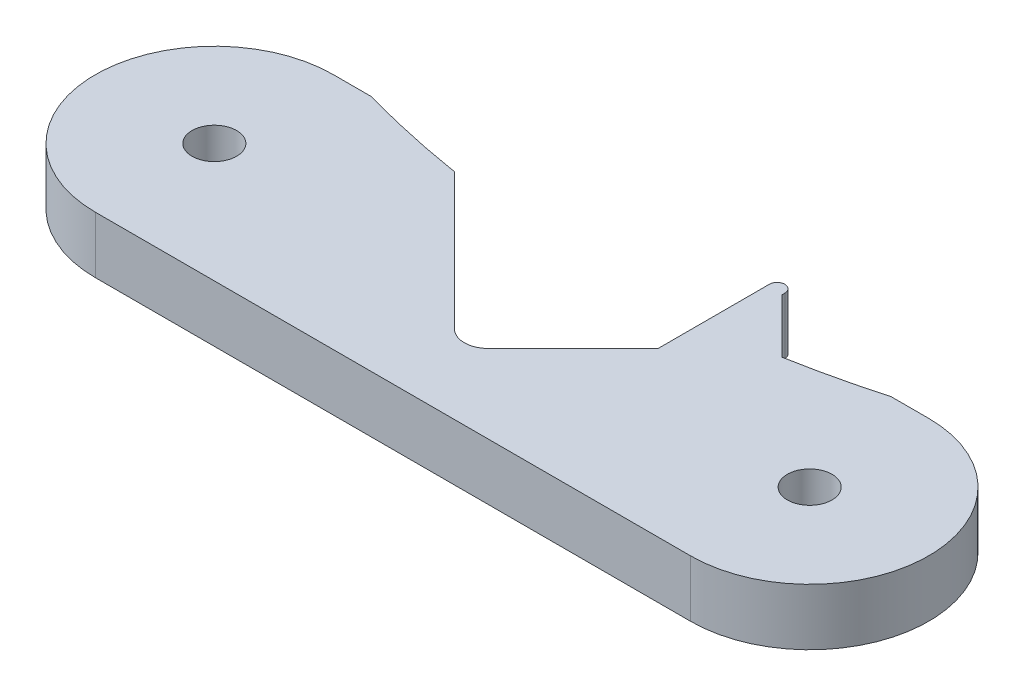
ISO-10303-21;
HEADER;
FILE_DESCRIPTION(('STEP AP214'),'2;1');
FILE_NAME('part.step','',(''),(''),'','','');
FILE_SCHEMA(('AUTOMOTIVE_DESIGN { 1 0 10303 214 1 1 1 1 }'));
ENDSEC;
DATA;
#1=APPLICATION_CONTEXT('core data for automotive mechanical design processes');
#2=APPLICATION_PROTOCOL_DEFINITION('international standard','automotive_design',2000,#1);
#3=PRODUCT_CONTEXT('',#1,'mechanical');
#4=PRODUCT('Part','Part','',(#3));
#5=PRODUCT_RELATED_PRODUCT_CATEGORY('part','',(#4));
#6=PRODUCT_DEFINITION_FORMATION('','',#4);
#7=PRODUCT_DEFINITION_CONTEXT('part definition',#1,'design');
#8=PRODUCT_DEFINITION('design','',#6,#7);
#9=PRODUCT_DEFINITION_SHAPE('','',#8);
#10=(LENGTH_UNIT() NAMED_UNIT(*) SI_UNIT(.MILLI.,.METRE.));
#11=(NAMED_UNIT(*) PLANE_ANGLE_UNIT() SI_UNIT($,.RADIAN.));
#12=(NAMED_UNIT(*) SI_UNIT($,.STERADIAN.) SOLID_ANGLE_UNIT());
#13=UNCERTAINTY_MEASURE_WITH_UNIT(LENGTH_MEASURE(1.E-05),#10,'distance_accuracy_value','');
#14=(GEOMETRIC_REPRESENTATION_CONTEXT(3) GLOBAL_UNCERTAINTY_ASSIGNED_CONTEXT((#13)) GLOBAL_UNIT_ASSIGNED_CONTEXT((#10,
#11,#12)) REPRESENTATION_CONTEXT('',''));
#15=CARTESIAN_POINT('',(0.,0.,0.));
#16=DIRECTION('',(0.,0.,1.));
#17=DIRECTION('',(1.,0.,0.));
#18=AXIS2_PLACEMENT_3D('',#15,#16,#17);
#19=CARTESIAN_POINT('',(-25.,4.7625,-5.));
#20=DIRECTION('',(0.,0.,1.));
#21=DIRECTION('',(1.,0.,0.));
#22=AXIS2_PLACEMENT_3D('',#19,#20,#21);
#23=PLANE('',#22);
#24=DIRECTION('',(-1.,0.,0.));
#25=VECTOR('',#24,1.);
#26=CARTESIAN_POINT('',(-25.,0.,-5.));
#27=LINE('',#26,#25);
#28=CARTESIAN_POINT('',(25.,0.,-5.));
#29=VERTEX_POINT('',#28);
#30=CARTESIAN_POINT('',(21.8403296678416,0.,-5.));
#31=VERTEX_POINT('',#30);
#32=EDGE_CURVE('E229',#29,#31,#27,.T.);
#33=ORIENTED_EDGE('',*,*,#32,.T.);
#34=DIRECTION('',(0.,1.,0.));
#35=VECTOR('',#34,1.);
#36=CARTESIAN_POINT('',(21.8403296678417,0.,-5.00000000000003));
#37=LINE('',#36,#35);
#38=CARTESIAN_POINT('',(21.8403296678416,4.7625,-5.));
#39=VERTEX_POINT('',#38);
#40=EDGE_CURVE('E11',#31,#39,#37,.T.);
#41=ORIENTED_EDGE('',*,*,#40,.T.);
#42=DIRECTION('',(-1.,0.,0.));
#43=VECTOR('',#42,1.);
#44=CARTESIAN_POINT('',(-25.,4.7625,-5.));
#45=LINE('',#44,#43);
#46=CARTESIAN_POINT('',(25.,4.7625,-5.));
#47=VERTEX_POINT('',#46);
#48=EDGE_CURVE('E233',#47,#39,#45,.T.);
#49=ORIENTED_EDGE('',*,*,#48,.F.);
#50=DIRECTION('',(0.,-1.,0.));
#51=VECTOR('',#50,1.);
#52=CARTESIAN_POINT('',(25.,4.7625,-5.));
#53=LINE('',#52,#51);
#54=EDGE_CURVE('E246',#47,#29,#53,.T.);
#55=ORIENTED_EDGE('',*,*,#54,.T.);
#56=EDGE_LOOP('',(#33,#41,#49,#55));
#57=FACE_BOUND('',#56,.T.);
#58=ADVANCED_FACE('F31',(#57),#23,.F.);
#59=CARTESIAN_POINT('',(-25.,4.7625,5.));
#60=DIRECTION('',(0.,1.,0.));
#61=DIRECTION('',(0.,0.,1.));
#62=AXIS2_PLACEMENT_3D('',#59,#60,#61);
#63=PLANE('',#62);
#64=CARTESIAN_POINT('',(0.,4.7625,-83.));
#65=DIRECTION('',(0.,1.,0.));
#66=DIRECTION('',(0.,0.,1.));
#67=AXIS2_PLACEMENT_3D('',#64,#65,#66);
#68=CIRCLE('',#67,81.);
#69=CARTESIAN_POINT('',(14.3776574255561,4.7625,-3.28624355261288));
#70=VERTEX_POINT('',#69);
#71=EDGE_CURVE('E198',#70,#39,#68,.T.);
#72=ORIENTED_EDGE('',*,*,#71,.F.);
#73=DIRECTION('',(-0.707106781186552,0.,-0.707106781186543));
#74=VECTOR('',#73,1.);
#75=CARTESIAN_POINT('',(9.85113542708869,4.7625,-7.81276555108019));
#76=LINE('',#75,#74);
#77=CARTESIAN_POINT('',(9.85113542708869,4.7625,-7.81276555108019));
#78=VERTEX_POINT('',#77);
#79=EDGE_CURVE('E161',#70,#78,#76,.T.);
#80=ORIENTED_EDGE('',*,*,#79,.T.);
#81=DIRECTION('',(0.,0.,-1.));
#82=VECTOR('',#81,1.);
#83=CARTESIAN_POINT('',(9.85113542708869,4.7625,-8.0627655510802));
#84=LINE('',#83,#82);
#85=CARTESIAN_POINT('',(9.85113542708869,4.7625,-8.0627655510802));
#86=VERTEX_POINT('',#85);
#87=EDGE_CURVE('E153',#78,#86,#84,.T.);
#88=ORIENTED_EDGE('',*,*,#87,.T.);
#89=CARTESIAN_POINT('',(9.20113542708869,4.7625,-8.0627655510802));
#90=DIRECTION('',(0.,1.,0.));
#91=DIRECTION('',(0.,0.,-1.));
#92=AXIS2_PLACEMENT_3D('',#89,#90,#91);
#93=CIRCLE('',#92,0.65);
#94=CARTESIAN_POINT('',(8.55113542708869,4.7625,-8.0627655510802));
#95=VERTEX_POINT('',#94);
#96=EDGE_CURVE('E148',#86,#95,#93,.T.);
#97=ORIENTED_EDGE('',*,*,#96,.T.);
#98=DIRECTION('',(0.,0.,1.));
#99=VECTOR('',#98,1.);
#100=CARTESIAN_POINT('',(8.55113542708869,4.7625,-8.0627655510802));
#101=LINE('',#100,#99);
#102=CARTESIAN_POINT('',(8.55113542708869,4.7625,1.27729169765749));
#103=VERTEX_POINT('',#102);
#104=EDGE_CURVE('E156',#95,#103,#101,.T.);
#105=ORIENTED_EDGE('',*,*,#104,.T.);
#106=DIRECTION('',(0.707106781186546,0.,-0.707106781186549));
#107=VECTOR('',#106,1.);
#108=CARTESIAN_POINT('',(1.4142135623731,4.7625,8.41421356237308));
#109=LINE('',#108,#107);
#110=CARTESIAN_POINT('',(1.4142135623731,4.7625,8.41421356237308));
#111=VERTEX_POINT('',#110);
#112=EDGE_CURVE('E206',#111,#103,#109,.T.);
#113=ORIENTED_EDGE('',*,*,#112,.F.);
#114=CARTESIAN_POINT('',(0.,4.7625,6.99999999999999));
#115=DIRECTION('',(0.,1.,0.));
#116=DIRECTION('',(0.,0.,1.));
#117=AXIS2_PLACEMENT_3D('',#114,#115,#116);
#118=CIRCLE('',#117,2.);
#119=CARTESIAN_POINT('',(-1.4142135623731,4.7625,8.41421356237308));
#120=VERTEX_POINT('',#119);
#121=EDGE_CURVE('E203',#120,#111,#118,.T.);
#122=ORIENTED_EDGE('',*,*,#121,.F.);
#123=DIRECTION('',(0.707106781186546,0.,0.707106781186549));
#124=VECTOR('',#123,1.);
#125=CARTESIAN_POINT('',(-12.8550005294901,4.7625,-3.02657340474394));
#126=LINE('',#125,#124);
#127=CARTESIAN_POINT('',(-12.8550005294901,4.7625,-3.02657340474394));
#128=VERTEX_POINT('',#127);
#129=EDGE_CURVE('E200',#128,#120,#126,.T.);
#130=ORIENTED_EDGE('',*,*,#129,.F.);
#131=CARTESIAN_POINT('',(-21.8403296678416,4.7625,-5.));
#132=VERTEX_POINT('',#131);
#133=EDGE_CURVE('E185',#132,#128,#68,.T.);
#134=ORIENTED_EDGE('',*,*,#133,.F.);
#135=CARTESIAN_POINT('',(-25.,4.7625,-5.));
#136=VERTEX_POINT('',#135);
#137=EDGE_CURVE('E55',#132,#136,#45,.T.);
#138=ORIENTED_EDGE('',*,*,#137,.T.);
#139=CARTESIAN_POINT('',(-25.,4.7625,5.));
#140=DIRECTION('',(0.,1.,0.));
#141=DIRECTION('',(0.,0.,1.));
#142=AXIS2_PLACEMENT_3D('',#139,#140,#141);
#143=CIRCLE('',#142,10.);
#144=CARTESIAN_POINT('',(-25.,4.7625,15.));
#145=VERTEX_POINT('',#144);
#146=EDGE_CURVE('E227',#136,#145,#143,.T.);
#147=ORIENTED_EDGE('',*,*,#146,.T.);
#148=DIRECTION('',(1.,0.,0.));
#149=VECTOR('',#148,1.);
#150=CARTESIAN_POINT('',(-25.,4.7625,15.));
#151=LINE('',#150,#149);
#152=CARTESIAN_POINT('',(25.,4.7625,15.));
#153=VERTEX_POINT('',#152);
#154=EDGE_CURVE('E84',#145,#153,#151,.T.);
#155=ORIENTED_EDGE('',*,*,#154,.T.);
#156=CARTESIAN_POINT('',(25.,4.7625,5.));
#157=DIRECTION('',(0.,1.,0.));
#158=DIRECTION('',(0.,0.,1.));
#159=AXIS2_PLACEMENT_3D('',#156,#157,#158);
#160=CIRCLE('',#159,10.);
#161=EDGE_CURVE('E231',#153,#47,#160,.T.);
#162=ORIENTED_EDGE('',*,*,#161,.T.);
#163=ORIENTED_EDGE('',*,*,#48,.T.);
#164=EDGE_LOOP('',(#72,#80,#88,#97,#105,#113,#122,#130,#134,#138,#147,#155,#162,#163));
#165=FACE_BOUND('',#164,.T.);
#166=CARTESIAN_POINT('',(-25.,4.7625,5.));
#167=DIRECTION('',(0.,1.,0.));
#168=DIRECTION('',(0.,0.,1.));
#169=AXIS2_PLACEMENT_3D('',#166,#167,#168);
#170=CIRCLE('',#169,1.875);
#171=CARTESIAN_POINT('',(-25.,4.7625,6.875));
#172=VERTEX_POINT('',#171);
#173=EDGE_CURVE('E221',#172,#172,#170,.T.);
#174=ORIENTED_EDGE('',*,*,#173,.F.);
#175=EDGE_LOOP('',(#174));
#176=FACE_BOUND('',#175,.T.);
#177=CARTESIAN_POINT('',(25.,4.7625,5.));
#178=DIRECTION('',(0.,1.,0.));
#179=DIRECTION('',(0.,0.,1.));
#180=AXIS2_PLACEMENT_3D('',#177,#178,#179);
#181=CIRCLE('',#180,1.875);
#182=CARTESIAN_POINT('',(25.,4.7625,6.875));
#183=VERTEX_POINT('',#182);
#184=EDGE_CURVE('E215',#183,#183,#181,.T.);
#185=ORIENTED_EDGE('',*,*,#184,.F.);
#186=EDGE_LOOP('',(#185));
#187=FACE_BOUND('',#186,.T.);
#188=ADVANCED_FACE('F164',(#165,#176,#187),#63,.T.);
#189=CARTESIAN_POINT('',(-25.,0.,5.));
#190=DIRECTION('',(0.,1.,0.));
#191=DIRECTION('',(0.,0.,1.));
#192=AXIS2_PLACEMENT_3D('',#189,#190,#191);
#193=PLANE('',#192);
#194=CARTESIAN_POINT('',(-25.,0.,5.));
#195=DIRECTION('',(0.,1.,0.));
#196=DIRECTION('',(0.,0.,1.));
#197=AXIS2_PLACEMENT_3D('',#194,#195,#196);
#198=CIRCLE('',#197,1.875);
#199=CARTESIAN_POINT('',(-25.,0.,6.875));
#200=VERTEX_POINT('',#199);
#201=EDGE_CURVE('E218',#200,#200,#198,.T.);
#202=ORIENTED_EDGE('',*,*,#201,.T.);
#203=EDGE_LOOP('',(#202));
#204=FACE_BOUND('',#203,.T.);
#205=DIRECTION('',(0.707106781186546,0.,-0.707106781186549));
#206=VECTOR('',#205,1.);
#207=CARTESIAN_POINT('',(1.4142135623731,0.,8.41421356237308));
#208=LINE('',#207,#206);
#209=CARTESIAN_POINT('',(1.4142135623731,0.,8.41421356237308));
#210=VERTEX_POINT('',#209);
#211=CARTESIAN_POINT('',(8.55113542708869,0.,1.27729169765749));
#212=VERTEX_POINT('',#211);
#213=EDGE_CURVE('E194',#210,#212,#208,.T.);
#214=ORIENTED_EDGE('',*,*,#213,.T.);
#215=DIRECTION('',(0.,0.,-1.));
#216=VECTOR('',#215,1.);
#217=CARTESIAN_POINT('',(8.55113542708869,0.,-8.0627655510802));
#218=LINE('',#217,#216);
#219=CARTESIAN_POINT('',(8.55113542708869,0.,-8.0627655510802));
#220=VERTEX_POINT('',#219);
#221=EDGE_CURVE('E183',#212,#220,#218,.T.);
#222=ORIENTED_EDGE('',*,*,#221,.T.);
#223=CARTESIAN_POINT('',(9.20113542708869,0.,-8.0627655510802));
#224=DIRECTION('',(0.,1.,0.));
#225=DIRECTION('',(0.,0.,1.));
#226=AXIS2_PLACEMENT_3D('',#223,#224,#225);
#227=CIRCLE('',#226,0.65);
#228=CARTESIAN_POINT('',(9.85113542708869,0.,-8.0627655510802));
#229=VERTEX_POINT('',#228);
#230=EDGE_CURVE('E150',#220,#229,#227,.F.);
#231=ORIENTED_EDGE('',*,*,#230,.T.);
#232=DIRECTION('',(0.,0.,1.));
#233=VECTOR('',#232,1.);
#234=CARTESIAN_POINT('',(9.85113542708869,0.,-8.0627655510802));
#235=LINE('',#234,#233);
#236=CARTESIAN_POINT('',(9.85113542708869,0.,-7.81276555108019));
#237=VERTEX_POINT('',#236);
#238=EDGE_CURVE('E282',#229,#237,#235,.T.);
#239=ORIENTED_EDGE('',*,*,#238,.T.);
#240=DIRECTION('',(0.707106781186552,0.,0.707106781186543));
#241=VECTOR('',#240,1.);
#242=CARTESIAN_POINT('',(9.85113542708869,0.,-7.81276555108019));
#243=LINE('',#242,#241);
#244=CARTESIAN_POINT('',(14.3776574255561,0.,-3.28624355261288));
#245=VERTEX_POINT('',#244);
#246=EDGE_CURVE('E176',#237,#245,#243,.T.);
#247=ORIENTED_EDGE('',*,*,#246,.T.);
#248=CARTESIAN_POINT('',(0.,0.,-83.));
#249=DIRECTION('',(0.,1.,0.));
#250=DIRECTION('',(0.,0.,1.));
#251=AXIS2_PLACEMENT_3D('',#248,#249,#250);
#252=CIRCLE('',#251,81.);
#253=EDGE_CURVE('E186',#245,#31,#252,.T.);
#254=ORIENTED_EDGE('',*,*,#253,.T.);
#255=ORIENTED_EDGE('',*,*,#32,.F.);
#256=CARTESIAN_POINT('',(25.,0.,5.));
#257=DIRECTION('',(0.,1.,0.));
#258=DIRECTION('',(0.,0.,1.));
#259=AXIS2_PLACEMENT_3D('',#256,#257,#258);
#260=CIRCLE('',#259,10.);
#261=CARTESIAN_POINT('',(25.,0.,15.));
#262=VERTEX_POINT('',#261);
#263=EDGE_CURVE('E241',#262,#29,#260,.T.);
#264=ORIENTED_EDGE('',*,*,#263,.F.);
#265=DIRECTION('',(1.,0.,0.));
#266=VECTOR('',#265,1.);
#267=CARTESIAN_POINT('',(-25.,0.,15.));
#268=LINE('',#267,#266);
#269=CARTESIAN_POINT('',(-25.,0.,15.));
#270=VERTEX_POINT('',#269);
#271=EDGE_CURVE('E239',#270,#262,#268,.T.);
#272=ORIENTED_EDGE('',*,*,#271,.F.);
#273=CARTESIAN_POINT('',(-25.,0.,5.));
#274=DIRECTION('',(0.,1.,0.));
#275=DIRECTION('',(0.,0.,1.));
#276=AXIS2_PLACEMENT_3D('',#273,#274,#275);
#277=CIRCLE('',#276,10.);
#278=CARTESIAN_POINT('',(-25.,0.,-5.));
#279=VERTEX_POINT('',#278);
#280=EDGE_CURVE('E224',#279,#270,#277,.T.);
#281=ORIENTED_EDGE('',*,*,#280,.F.);
#282=CARTESIAN_POINT('',(-21.8403296678416,0.,-5.));
#283=VERTEX_POINT('',#282);
#284=EDGE_CURVE('E76',#283,#279,#27,.T.);
#285=ORIENTED_EDGE('',*,*,#284,.F.);
#286=CARTESIAN_POINT('',(-12.8550005294901,0.,-3.02657340474394));
#287=VERTEX_POINT('',#286);
#288=EDGE_CURVE('E46',#283,#287,#252,.T.);
#289=ORIENTED_EDGE('',*,*,#288,.T.);
#290=DIRECTION('',(0.707106781186546,0.,0.707106781186549));
#291=VECTOR('',#290,1.);
#292=CARTESIAN_POINT('',(-12.8550005294901,0.,-3.02657340474394));
#293=LINE('',#292,#291);
#294=CARTESIAN_POINT('',(-1.4142135623731,0.,8.41421356237308));
#295=VERTEX_POINT('',#294);
#296=EDGE_CURVE('E188',#287,#295,#293,.T.);
#297=ORIENTED_EDGE('',*,*,#296,.T.);
#298=CARTESIAN_POINT('',(0.,0.,6.99999999999999));
#299=DIRECTION('',(0.,1.,0.));
#300=DIRECTION('',(0.,0.,1.));
#301=AXIS2_PLACEMENT_3D('',#298,#299,#300);
#302=CIRCLE('',#301,2.);
#303=EDGE_CURVE('E191',#295,#210,#302,.T.);
#304=ORIENTED_EDGE('',*,*,#303,.T.);
#305=EDGE_LOOP('',(#214,#222,#231,#239,#247,#254,#255,#264,#272,#281,#285,#289,#297,#304));
#306=FACE_BOUND('',#305,.T.);
#307=CARTESIAN_POINT('',(25.,0.,5.));
#308=DIRECTION('',(0.,1.,0.));
#309=DIRECTION('',(0.,0.,1.));
#310=AXIS2_PLACEMENT_3D('',#307,#308,#309);
#311=CIRCLE('',#310,1.875);
#312=CARTESIAN_POINT('',(25.,0.,6.875));
#313=VERTEX_POINT('',#312);
#314=EDGE_CURVE('E210',#313,#313,#311,.T.);
#315=ORIENTED_EDGE('',*,*,#314,.T.);
#316=EDGE_LOOP('',(#315));
#317=FACE_BOUND('',#316,.T.);
#318=ADVANCED_FACE('F256',(#204,#306,#317),#193,.F.);
#319=CARTESIAN_POINT('',(-25.,4.7625,5.));
#320=DIRECTION('',(0.,-1.,0.));
#321=DIRECTION('',(0.,0.,-1.));
#322=AXIS2_PLACEMENT_3D('',#319,#320,#321);
#323=CYLINDRICAL_SURFACE('',#322,10.);
#324=ORIENTED_EDGE('',*,*,#280,.T.);
#325=DIRECTION('',(0.,-1.,0.));
#326=VECTOR('',#325,1.);
#327=CARTESIAN_POINT('',(-25.,4.7625,15.));
#328=LINE('',#327,#326);
#329=EDGE_CURVE('E252',#145,#270,#328,.T.);
#330=ORIENTED_EDGE('',*,*,#329,.F.);
#331=ORIENTED_EDGE('',*,*,#146,.F.);
#332=DIRECTION('',(0.,-1.,0.));
#333=VECTOR('',#332,1.);
#334=CARTESIAN_POINT('',(-25.,4.7625,-5.));
#335=LINE('',#334,#333);
#336=EDGE_CURVE('E236',#136,#279,#335,.T.);
#337=ORIENTED_EDGE('',*,*,#336,.T.);
#338=EDGE_LOOP('',(#324,#330,#331,#337));
#339=FACE_BOUND('',#338,.T.);
#340=ADVANCED_FACE('F33',(#339),#323,.T.);
#341=CARTESIAN_POINT('',(-25.,4.7625,15.));
#342=DIRECTION('',(0.,0.,-1.));
#343=DIRECTION('',(-1.,0.,0.));
#344=AXIS2_PLACEMENT_3D('',#341,#342,#343);
#345=PLANE('',#344);
#346=ORIENTED_EDGE('',*,*,#271,.T.);
#347=DIRECTION('',(0.,-1.,0.));
#348=VECTOR('',#347,1.);
#349=CARTESIAN_POINT('',(25.,4.7625,15.));
#350=LINE('',#349,#348);
#351=EDGE_CURVE('E249',#153,#262,#350,.T.);
#352=ORIENTED_EDGE('',*,*,#351,.F.);
#353=ORIENTED_EDGE('',*,*,#154,.F.);
#354=ORIENTED_EDGE('',*,*,#329,.T.);
#355=EDGE_LOOP('',(#346,#352,#353,#354));
#356=FACE_BOUND('',#355,.T.);
#357=ADVANCED_FACE('F264',(#356),#345,.F.);
#358=CARTESIAN_POINT('',(25.,4.7625,5.));
#359=DIRECTION('',(0.,-1.,0.));
#360=DIRECTION('',(0.,0.,-1.));
#361=AXIS2_PLACEMENT_3D('',#358,#359,#360);
#362=CYLINDRICAL_SURFACE('',#361,10.);
#363=ORIENTED_EDGE('',*,*,#263,.T.);
#364=ORIENTED_EDGE('',*,*,#54,.F.);
#365=ORIENTED_EDGE('',*,*,#161,.F.);
#366=ORIENTED_EDGE('',*,*,#351,.T.);
#367=EDGE_LOOP('',(#363,#364,#365,#366));
#368=FACE_BOUND('',#367,.T.);
#369=ADVANCED_FACE('F266',(#368),#362,.T.);
#370=ORIENTED_EDGE('',*,*,#137,.F.);
#371=DIRECTION('',(0.,1.,0.));
#372=VECTOR('',#371,1.);
#373=CARTESIAN_POINT('',(-21.8403296678417,0.,-5.00000000000003));
#374=LINE('',#373,#372);
#375=EDGE_CURVE('E39',#132,#283,#374,.F.);
#376=ORIENTED_EDGE('',*,*,#375,.T.);
#377=ORIENTED_EDGE('',*,*,#284,.T.);
#378=ORIENTED_EDGE('',*,*,#336,.F.);
#379=EDGE_LOOP('',(#370,#376,#377,#378));
#380=FACE_BOUND('',#379,.T.);
#381=ADVANCED_FACE('F253',(#380),#23,.F.);
#382=CARTESIAN_POINT('',(-25.,4.7625,5.));
#383=DIRECTION('',(0.,-1.,0.));
#384=DIRECTION('',(0.,0.,-1.));
#385=AXIS2_PLACEMENT_3D('',#382,#383,#384);
#386=CYLINDRICAL_SURFACE('',#385,1.875);
#387=ORIENTED_EDGE('',*,*,#173,.T.);
#388=EDGE_LOOP('',(#387));
#389=FACE_BOUND('',#388,.T.);
#390=ORIENTED_EDGE('',*,*,#201,.F.);
#391=EDGE_LOOP('',(#390));
#392=FACE_BOUND('',#391,.T.);
#393=ADVANCED_FACE('F315',(#389,#392),#386,.F.);
#394=CARTESIAN_POINT('',(25.,4.7625,5.));
#395=DIRECTION('',(0.,-1.,0.));
#396=DIRECTION('',(0.,0.,-1.));
#397=AXIS2_PLACEMENT_3D('',#394,#395,#396);
#398=CYLINDRICAL_SURFACE('',#397,1.875);
#399=ORIENTED_EDGE('',*,*,#184,.T.);
#400=EDGE_LOOP('',(#399));
#401=FACE_BOUND('',#400,.T.);
#402=ORIENTED_EDGE('',*,*,#314,.F.);
#403=EDGE_LOOP('',(#402));
#404=FACE_BOUND('',#403,.T.);
#405=ADVANCED_FACE('F303',(#401,#404),#398,.F.);
#406=CARTESIAN_POINT('',(0.,0.,-83.));
#407=DIRECTION('',(0.,1.,0.));
#408=DIRECTION('',(0.,0.,1.));
#409=AXIS2_PLACEMENT_3D('',#406,#407,#408);
#410=CYLINDRICAL_SURFACE('',#409,81.);
#411=ORIENTED_EDGE('',*,*,#253,.F.);
#412=DIRECTION('',(0.,1.,0.));
#413=VECTOR('',#412,1.);
#414=CARTESIAN_POINT('',(14.3776574255561,-11.5650163178303,-3.28624355261288));
#415=LINE('',#414,#413);
#416=EDGE_CURVE('E179',#245,#70,#415,.T.);
#417=ORIENTED_EDGE('',*,*,#416,.T.);
#418=ORIENTED_EDGE('',*,*,#71,.T.);
#419=ORIENTED_EDGE('',*,*,#40,.F.);
#420=EDGE_LOOP('',(#411,#417,#418,#419));
#421=FACE_BOUND('',#420,.T.);
#422=ADVANCED_FACE('F273',(#421),#410,.F.);
#423=ORIENTED_EDGE('',*,*,#133,.T.);
#424=DIRECTION('',(0.,1.,0.));
#425=VECTOR('',#424,1.);
#426=CARTESIAN_POINT('',(-12.8550005294901,0.,-3.02657340474394));
#427=LINE('',#426,#425);
#428=EDGE_CURVE('E197',#287,#128,#427,.T.);
#429=ORIENTED_EDGE('',*,*,#428,.F.);
#430=ORIENTED_EDGE('',*,*,#288,.F.);
#431=ORIENTED_EDGE('',*,*,#375,.F.);
#432=EDGE_LOOP('',(#423,#429,#430,#431));
#433=FACE_BOUND('',#432,.T.);
#434=ADVANCED_FACE('F295',(#433),#410,.F.);
#435=CARTESIAN_POINT('',(1.4142135623731,0.,8.41421356237308));
#436=DIRECTION('',(0.707106781186549,0.,0.707106781186546));
#437=DIRECTION('',(0.707106781186546,0.,-0.707106781186549));
#438=AXIS2_PLACEMENT_3D('',#435,#436,#437);
#439=PLANE('',#438);
#440=ORIENTED_EDGE('',*,*,#112,.T.);
#441=DIRECTION('',(0.,1.,0.));
#442=VECTOR('',#441,1.);
#443=CARTESIAN_POINT('',(8.55113542708869,-11.5650163178303,1.27729169765749));
#444=LINE('',#443,#442);
#445=EDGE_CURVE('E152',#212,#103,#444,.T.);
#446=ORIENTED_EDGE('',*,*,#445,.F.);
#447=ORIENTED_EDGE('',*,*,#213,.F.);
#448=DIRECTION('',(0.,1.,0.));
#449=VECTOR('',#448,1.);
#450=CARTESIAN_POINT('',(1.4142135623731,0.,8.41421356237308));
#451=LINE('',#450,#449);
#452=EDGE_CURVE('E208',#210,#111,#451,.T.);
#453=ORIENTED_EDGE('',*,*,#452,.T.);
#454=EDGE_LOOP('',(#440,#446,#447,#453));
#455=FACE_BOUND('',#454,.T.);
#456=ADVANCED_FACE('F286',(#455),#439,.F.);
#457=CARTESIAN_POINT('',(0.,0.,6.99999999999999));
#458=DIRECTION('',(0.,1.,0.));
#459=DIRECTION('',(0.,0.,1.));
#460=AXIS2_PLACEMENT_3D('',#457,#458,#459);
#461=CYLINDRICAL_SURFACE('',#460,2.);
#462=ORIENTED_EDGE('',*,*,#121,.T.);
#463=ORIENTED_EDGE('',*,*,#452,.F.);
#464=ORIENTED_EDGE('',*,*,#303,.F.);
#465=DIRECTION('',(0.,1.,0.));
#466=VECTOR('',#465,1.);
#467=CARTESIAN_POINT('',(-1.4142135623731,0.,8.41421356237308));
#468=LINE('',#467,#466);
#469=EDGE_CURVE('E211',#295,#120,#468,.T.);
#470=ORIENTED_EDGE('',*,*,#469,.T.);
#471=EDGE_LOOP('',(#462,#463,#464,#470));
#472=FACE_BOUND('',#471,.T.);
#473=ADVANCED_FACE('F290',(#472),#461,.F.);
#474=CARTESIAN_POINT('',(-12.8550005294901,0.,-3.02657340474394));
#475=DIRECTION('',(-0.707106781186549,0.,0.707106781186546));
#476=DIRECTION('',(0.707106781186546,0.,0.707106781186549));
#477=AXIS2_PLACEMENT_3D('',#474,#475,#476);
#478=PLANE('',#477);
#479=ORIENTED_EDGE('',*,*,#129,.T.);
#480=ORIENTED_EDGE('',*,*,#469,.F.);
#481=ORIENTED_EDGE('',*,*,#296,.F.);
#482=ORIENTED_EDGE('',*,*,#428,.T.);
#483=EDGE_LOOP('',(#479,#480,#481,#482));
#484=FACE_BOUND('',#483,.T.);
#485=ADVANCED_FACE('F294',(#484),#478,.F.);
#486=CARTESIAN_POINT('',(9.20113542708869,-11.5650163178303,-8.0627655510802));
#487=DIRECTION('',(0.,1.,0.));
#488=DIRECTION('',(0.,0.,1.));
#489=AXIS2_PLACEMENT_3D('',#486,#487,#488);
#490=CYLINDRICAL_SURFACE('',#489,0.65);
#491=ORIENTED_EDGE('',*,*,#230,.F.);
#492=DIRECTION('',(0.,1.,0.));
#493=VECTOR('',#492,1.);
#494=CARTESIAN_POINT('',(8.55113542708869,-11.5650163178303,-8.0627655510802));
#495=LINE('',#494,#493);
#496=EDGE_CURVE('E143',#220,#95,#495,.T.);
#497=ORIENTED_EDGE('',*,*,#496,.T.);
#498=ORIENTED_EDGE('',*,*,#96,.F.);
#499=DIRECTION('',(0.,1.,0.));
#500=VECTOR('',#499,1.);
#501=CARTESIAN_POINT('',(9.85113542708869,-11.5650163178303,-8.0627655510802));
#502=LINE('',#501,#500);
#503=EDGE_CURVE('E174',#229,#86,#502,.T.);
#504=ORIENTED_EDGE('',*,*,#503,.F.);
#505=EDGE_LOOP('',(#491,#497,#498,#504));
#506=FACE_BOUND('',#505,.T.);
#507=ADVANCED_FACE('F145',(#506),#490,.T.);
#508=CARTESIAN_POINT('',(9.85113542708869,-11.5650163178303,-8.0627655510802));
#509=DIRECTION('',(1.,0.,0.));
#510=DIRECTION('',(0.,0.,-1.));
#511=AXIS2_PLACEMENT_3D('',#508,#509,#510);
#512=PLANE('',#511);
#513=ORIENTED_EDGE('',*,*,#238,.F.);
#514=ORIENTED_EDGE('',*,*,#503,.T.);
#515=ORIENTED_EDGE('',*,*,#87,.F.);
#516=DIRECTION('',(0.,1.,0.));
#517=VECTOR('',#516,1.);
#518=CARTESIAN_POINT('',(9.85113542708869,-11.5650163178303,-7.81276555108019));
#519=LINE('',#518,#517);
#520=EDGE_CURVE('E177',#237,#78,#519,.T.);
#521=ORIENTED_EDGE('',*,*,#520,.F.);
#522=EDGE_LOOP('',(#513,#514,#515,#521));
#523=FACE_BOUND('',#522,.T.);
#524=ADVANCED_FACE('F281',(#523),#512,.T.);
#525=CARTESIAN_POINT('',(9.85113542708869,-11.5650163178303,-7.81276555108019));
#526=DIRECTION('',(0.707106781186543,0.,-0.707106781186552));
#527=DIRECTION('',(-0.707106781186552,0.,-0.707106781186543));
#528=AXIS2_PLACEMENT_3D('',#525,#526,#527);
#529=PLANE('',#528);
#530=ORIENTED_EDGE('',*,*,#246,.F.);
#531=ORIENTED_EDGE('',*,*,#520,.T.);
#532=ORIENTED_EDGE('',*,*,#79,.F.);
#533=ORIENTED_EDGE('',*,*,#416,.F.);
#534=EDGE_LOOP('',(#530,#531,#532,#533));
#535=FACE_BOUND('',#534,.T.);
#536=ADVANCED_FACE('F277',(#535),#529,.T.);
#537=CARTESIAN_POINT('',(8.55113542708869,-11.5650163178303,-8.0627655510802));
#538=DIRECTION('',(-1.,0.,0.));
#539=DIRECTION('',(0.,0.,1.));
#540=AXIS2_PLACEMENT_3D('',#537,#538,#539);
#541=PLANE('',#540);
#542=ORIENTED_EDGE('',*,*,#221,.F.);
#543=ORIENTED_EDGE('',*,*,#445,.T.);
#544=ORIENTED_EDGE('',*,*,#104,.F.);
#545=ORIENTED_EDGE('',*,*,#496,.F.);
#546=EDGE_LOOP('',(#542,#543,#544,#545));
#547=FACE_BOUND('',#546,.T.);
#548=ADVANCED_FACE('F157',(#547),#541,.T.);
#549=CLOSED_SHELL('',(#58,#188,#318,#340,#357,#369,#381,#393,#405,#422,#434,#456,#473,#485,#507,
#524,#536,#548));
#550=MANIFOLD_SOLID_BREP('B2',#549);
#551=ADVANCED_BREP_SHAPE_REPRESENTATION('',(#18,#550),#14);
#552=SHAPE_DEFINITION_REPRESENTATION(#9,#551);
ENDSEC;
END-ISO-10303-21;
